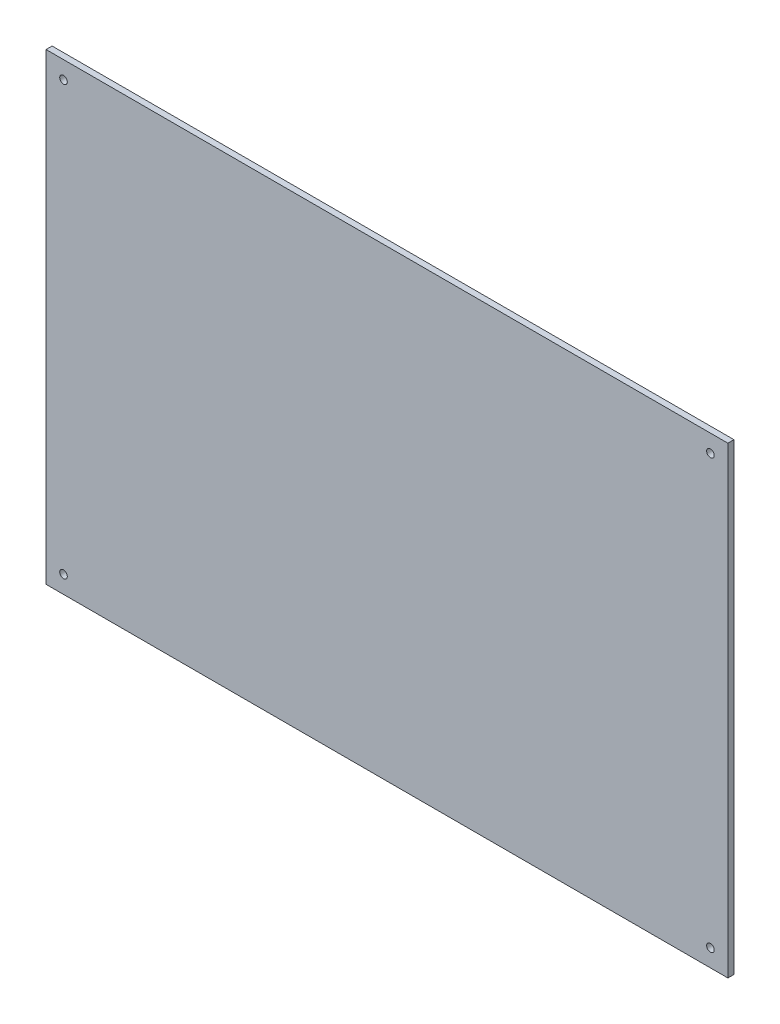
ISO-10303-21;
HEADER;
FILE_DESCRIPTION(('STEP AP214'),'2;1');
FILE_NAME('part.step','',(''),(''),'','','');
FILE_SCHEMA(('AUTOMOTIVE_DESIGN { 1 0 10303 214 1 1 1 1 }'));
ENDSEC;
DATA;
#1=APPLICATION_CONTEXT('core data for automotive mechanical design processes');
#2=APPLICATION_PROTOCOL_DEFINITION('international standard','automotive_design',2000,#1);
#3=PRODUCT_CONTEXT('',#1,'mechanical');
#4=PRODUCT('Part','Part','',(#3));
#5=PRODUCT_RELATED_PRODUCT_CATEGORY('part','',(#4));
#6=PRODUCT_DEFINITION_FORMATION('','',#4);
#7=PRODUCT_DEFINITION_CONTEXT('part definition',#1,'design');
#8=PRODUCT_DEFINITION('design','',#6,#7);
#9=PRODUCT_DEFINITION_SHAPE('','',#8);
#10=(LENGTH_UNIT() NAMED_UNIT(*) SI_UNIT(.MILLI.,.METRE.));
#11=(NAMED_UNIT(*) PLANE_ANGLE_UNIT() SI_UNIT($,.RADIAN.));
#12=(NAMED_UNIT(*) SI_UNIT($,.STERADIAN.) SOLID_ANGLE_UNIT());
#13=UNCERTAINTY_MEASURE_WITH_UNIT(LENGTH_MEASURE(1.E-05),#10,'distance_accuracy_value','');
#14=(GEOMETRIC_REPRESENTATION_CONTEXT(3) GLOBAL_UNCERTAINTY_ASSIGNED_CONTEXT((#13)) GLOBAL_UNIT_ASSIGNED_CONTEXT((#10,
#11,#12)) REPRESENTATION_CONTEXT('',''));
#15=CARTESIAN_POINT('',(0.,0.,0.));
#16=DIRECTION('',(0.,0.,1.));
#17=DIRECTION('',(1.,0.,0.));
#18=AXIS2_PLACEMENT_3D('',#15,#16,#17);
#19=CARTESIAN_POINT('',(0.,0.,4.));
#20=DIRECTION('',(0.,0.,1.));
#21=DIRECTION('',(1.,0.,0.));
#22=AXIS2_PLACEMENT_3D('',#19,#20,#21);
#23=PLANE('',#22);
#24=CARTESIAN_POINT('',(-11.5000000000001,293.5,4.));
#25=DIRECTION('',(0.,0.,1.));
#26=DIRECTION('',(-1.,0.,0.));
#27=AXIS2_PLACEMENT_3D('',#24,#25,#26);
#28=CIRCLE('',#27,2.50000000000002);
#29=CARTESIAN_POINT('',(-14.0000000000001,293.5,4.));
#30=VERTEX_POINT('',#29);
#31=EDGE_CURVE('E127',#30,#30,#28,.T.);
#32=ORIENTED_EDGE('',*,*,#31,.F.);
#33=EDGE_LOOP('',(#32));
#34=FACE_BOUND('',#33,.T.);
#35=CARTESIAN_POINT('',(-437.5,293.5,4.));
#36=DIRECTION('',(0.,0.,1.));
#37=DIRECTION('',(1.,0.,0.));
#38=AXIS2_PLACEMENT_3D('',#35,#36,#37);
#39=CIRCLE('',#38,2.50000000000002);
#40=CARTESIAN_POINT('',(-435.,293.5,4.));
#41=VERTEX_POINT('',#40);
#42=EDGE_CURVE('E106',#41,#41,#39,.T.);
#43=ORIENTED_EDGE('',*,*,#42,.F.);
#44=EDGE_LOOP('',(#43));
#45=FACE_BOUND('',#44,.T.);
#46=DIRECTION('',(0.,1.,0.));
#47=VECTOR('',#46,1.);
#48=CARTESIAN_POINT('',(0.,0.,4.));
#49=LINE('',#48,#47);
#50=CARTESIAN_POINT('',(0.,0.,4.));
#51=VERTEX_POINT('',#50);
#52=CARTESIAN_POINT('',(-1.11022302462516E-13,305.,4.));
#53=VERTEX_POINT('',#52);
#54=EDGE_CURVE('E91',#51,#53,#49,.T.);
#55=ORIENTED_EDGE('',*,*,#54,.T.);
#56=DIRECTION('',(-1.,0.,0.));
#57=VECTOR('',#56,1.);
#58=CARTESIAN_POINT('',(-1.11022302462516E-13,305.,4.));
#59=LINE('',#58,#57);
#60=CARTESIAN_POINT('',(-449.,305.,4.));
#61=VERTEX_POINT('',#60);
#62=EDGE_CURVE('E86',#53,#61,#59,.T.);
#63=ORIENTED_EDGE('',*,*,#62,.T.);
#64=DIRECTION('',(0.,-1.,0.));
#65=VECTOR('',#64,1.);
#66=CARTESIAN_POINT('',(-449.,0.,4.));
#67=LINE('',#66,#65);
#68=CARTESIAN_POINT('',(-449.,0.,4.));
#69=VERTEX_POINT('',#68);
#70=EDGE_CURVE('E89',#61,#69,#67,.T.);
#71=ORIENTED_EDGE('',*,*,#70,.T.);
#72=DIRECTION('',(1.,0.,0.));
#73=VECTOR('',#72,1.);
#74=CARTESIAN_POINT('',(0.,0.,4.));
#75=LINE('',#74,#73);
#76=EDGE_CURVE('E56',#69,#51,#75,.T.);
#77=ORIENTED_EDGE('',*,*,#76,.T.);
#78=EDGE_LOOP('',(#55,#63,#71,#77));
#79=FACE_BOUND('',#78,.T.);
#80=CARTESIAN_POINT('',(-437.5,11.5,4.));
#81=DIRECTION('',(0.,0.,1.));
#82=DIRECTION('',(-1.,0.,0.));
#83=AXIS2_PLACEMENT_3D('',#80,#81,#82);
#84=CIRCLE('',#83,2.50000000000002);
#85=CARTESIAN_POINT('',(-440.,11.5,4.));
#86=VERTEX_POINT('',#85);
#87=EDGE_CURVE('E121',#86,#86,#84,.T.);
#88=ORIENTED_EDGE('',*,*,#87,.F.);
#89=EDGE_LOOP('',(#88));
#90=FACE_BOUND('',#89,.T.);
#91=CARTESIAN_POINT('',(-11.5000000000001,11.5,4.));
#92=DIRECTION('',(0.,0.,1.));
#93=DIRECTION('',(1.,0.,0.));
#94=AXIS2_PLACEMENT_3D('',#91,#92,#93);
#95=CIRCLE('',#94,2.50000000000002);
#96=CARTESIAN_POINT('',(-9.00000000000005,11.5,4.));
#97=VERTEX_POINT('',#96);
#98=EDGE_CURVE('E133',#97,#97,#95,.T.);
#99=ORIENTED_EDGE('',*,*,#98,.F.);
#100=EDGE_LOOP('',(#99));
#101=FACE_BOUND('',#100,.T.);
#102=ADVANCED_FACE('F39',(#34,#45,#79,#90,#101),#23,.T.);
#103=CARTESIAN_POINT('',(0.,0.,0.));
#104=DIRECTION('',(0.,0.,1.));
#105=DIRECTION('',(1.,0.,0.));
#106=AXIS2_PLACEMENT_3D('',#103,#104,#105);
#107=PLANE('',#106);
#108=DIRECTION('',(0.,1.,0.));
#109=VECTOR('',#108,1.);
#110=CARTESIAN_POINT('',(0.,0.,0.));
#111=LINE('',#110,#109);
#112=CARTESIAN_POINT('',(0.,0.,0.));
#113=VERTEX_POINT('',#112);
#114=CARTESIAN_POINT('',(-1.11022302462516E-13,305.,0.));
#115=VERTEX_POINT('',#114);
#116=EDGE_CURVE('E103',#113,#115,#111,.T.);
#117=ORIENTED_EDGE('',*,*,#116,.F.);
#118=DIRECTION('',(1.,0.,0.));
#119=VECTOR('',#118,1.);
#120=CARTESIAN_POINT('',(0.,0.,0.));
#121=LINE('',#120,#119);
#122=CARTESIAN_POINT('',(-449.,0.,0.));
#123=VERTEX_POINT('',#122);
#124=EDGE_CURVE('E79',#123,#113,#121,.T.);
#125=ORIENTED_EDGE('',*,*,#124,.F.);
#126=DIRECTION('',(0.,-1.,0.));
#127=VECTOR('',#126,1.);
#128=CARTESIAN_POINT('',(-449.,0.,0.));
#129=LINE('',#128,#127);
#130=CARTESIAN_POINT('',(-449.,305.,0.));
#131=VERTEX_POINT('',#130);
#132=EDGE_CURVE('E73',#131,#123,#129,.T.);
#133=ORIENTED_EDGE('',*,*,#132,.F.);
#134=DIRECTION('',(-1.,0.,0.));
#135=VECTOR('',#134,1.);
#136=CARTESIAN_POINT('',(-1.11022302462516E-13,305.,0.));
#137=LINE('',#136,#135);
#138=EDGE_CURVE('E95',#115,#131,#137,.T.);
#139=ORIENTED_EDGE('',*,*,#138,.F.);
#140=EDGE_LOOP('',(#117,#125,#133,#139));
#141=FACE_BOUND('',#140,.T.);
#142=CARTESIAN_POINT('',(-437.5,293.5,0.));
#143=DIRECTION('',(0.,0.,1.));
#144=DIRECTION('',(1.,0.,0.));
#145=AXIS2_PLACEMENT_3D('',#142,#143,#144);
#146=CIRCLE('',#145,2.50000000000002);
#147=CARTESIAN_POINT('',(-435.,293.5,0.));
#148=VERTEX_POINT('',#147);
#149=EDGE_CURVE('E118',#148,#148,#146,.T.);
#150=ORIENTED_EDGE('',*,*,#149,.T.);
#151=EDGE_LOOP('',(#150));
#152=FACE_BOUND('',#151,.T.);
#153=CARTESIAN_POINT('',(-437.5,11.5,0.));
#154=DIRECTION('',(0.,0.,1.));
#155=DIRECTION('',(-1.,0.,0.));
#156=AXIS2_PLACEMENT_3D('',#153,#154,#155);
#157=CIRCLE('',#156,2.50000000000002);
#158=CARTESIAN_POINT('',(-440.,11.5,0.));
#159=VERTEX_POINT('',#158);
#160=EDGE_CURVE('E124',#159,#159,#157,.T.);
#161=ORIENTED_EDGE('',*,*,#160,.T.);
#162=EDGE_LOOP('',(#161));
#163=FACE_BOUND('',#162,.T.);
#164=CARTESIAN_POINT('',(-11.5000000000001,293.5,0.));
#165=DIRECTION('',(0.,0.,1.));
#166=DIRECTION('',(-1.,0.,0.));
#167=AXIS2_PLACEMENT_3D('',#164,#165,#166);
#168=CIRCLE('',#167,2.50000000000002);
#169=CARTESIAN_POINT('',(-14.0000000000001,293.5,0.));
#170=VERTEX_POINT('',#169);
#171=EDGE_CURVE('E130',#170,#170,#168,.T.);
#172=ORIENTED_EDGE('',*,*,#171,.T.);
#173=EDGE_LOOP('',(#172));
#174=FACE_BOUND('',#173,.T.);
#175=CARTESIAN_POINT('',(-11.5000000000001,11.5,0.));
#176=DIRECTION('',(0.,0.,1.));
#177=DIRECTION('',(1.,0.,0.));
#178=AXIS2_PLACEMENT_3D('',#175,#176,#177);
#179=CIRCLE('',#178,2.50000000000002);
#180=CARTESIAN_POINT('',(-9.00000000000005,11.5,0.));
#181=VERTEX_POINT('',#180);
#182=EDGE_CURVE('E136',#181,#181,#179,.T.);
#183=ORIENTED_EDGE('',*,*,#182,.T.);
#184=EDGE_LOOP('',(#183));
#185=FACE_BOUND('',#184,.T.);
#186=ADVANCED_FACE('F114',(#141,#152,#163,#174,#185),#107,.F.);
#187=CARTESIAN_POINT('',(0.,0.,4.));
#188=DIRECTION('',(-1.,0.,0.));
#189=DIRECTION('',(0.,-1.,0.));
#190=AXIS2_PLACEMENT_3D('',#187,#188,#189);
#191=PLANE('',#190);
#192=ORIENTED_EDGE('',*,*,#116,.T.);
#193=DIRECTION('',(0.,0.,-1.));
#194=VECTOR('',#193,1.);
#195=CARTESIAN_POINT('',(-1.11022302462516E-13,305.,4.));
#196=LINE('',#195,#194);
#197=EDGE_CURVE('E11',#53,#115,#196,.T.);
#198=ORIENTED_EDGE('',*,*,#197,.F.);
#199=ORIENTED_EDGE('',*,*,#54,.F.);
#200=DIRECTION('',(0.,0.,-1.));
#201=VECTOR('',#200,1.);
#202=CARTESIAN_POINT('',(0.,0.,4.));
#203=LINE('',#202,#201);
#204=EDGE_CURVE('E99',#51,#113,#203,.T.);
#205=ORIENTED_EDGE('',*,*,#204,.T.);
#206=EDGE_LOOP('',(#192,#198,#199,#205));
#207=FACE_BOUND('',#206,.T.);
#208=ADVANCED_FACE('F41',(#207),#191,.F.);
#209=CARTESIAN_POINT('',(-1.11022302462516E-13,305.,4.));
#210=DIRECTION('',(0.,-1.,0.));
#211=DIRECTION('',(1.,0.,0.));
#212=AXIS2_PLACEMENT_3D('',#209,#210,#211);
#213=PLANE('',#212);
#214=ORIENTED_EDGE('',*,*,#138,.T.);
#215=DIRECTION('',(0.,0.,-1.));
#216=VECTOR('',#215,1.);
#217=CARTESIAN_POINT('',(-449.,305.,4.));
#218=LINE('',#217,#216);
#219=EDGE_CURVE('E48',#61,#131,#218,.T.);
#220=ORIENTED_EDGE('',*,*,#219,.F.);
#221=ORIENTED_EDGE('',*,*,#62,.F.);
#222=ORIENTED_EDGE('',*,*,#197,.T.);
#223=EDGE_LOOP('',(#214,#220,#221,#222));
#224=FACE_BOUND('',#223,.T.);
#225=ADVANCED_FACE('F94',(#224),#213,.F.);
#226=CARTESIAN_POINT('',(-449.,0.,4.));
#227=DIRECTION('',(1.,0.,0.));
#228=DIRECTION('',(0.,1.,0.));
#229=AXIS2_PLACEMENT_3D('',#226,#227,#228);
#230=PLANE('',#229);
#231=ORIENTED_EDGE('',*,*,#132,.T.);
#232=DIRECTION('',(0.,0.,-1.));
#233=VECTOR('',#232,1.);
#234=CARTESIAN_POINT('',(-449.,0.,4.));
#235=LINE('',#234,#233);
#236=EDGE_CURVE('E96',#69,#123,#235,.T.);
#237=ORIENTED_EDGE('',*,*,#236,.F.);
#238=ORIENTED_EDGE('',*,*,#70,.F.);
#239=ORIENTED_EDGE('',*,*,#219,.T.);
#240=EDGE_LOOP('',(#231,#237,#238,#239));
#241=FACE_BOUND('',#240,.T.);
#242=ADVANCED_FACE('F97',(#241),#230,.F.);
#243=CARTESIAN_POINT('',(0.,0.,4.));
#244=DIRECTION('',(0.,1.,0.));
#245=DIRECTION('',(-1.,0.,0.));
#246=AXIS2_PLACEMENT_3D('',#243,#244,#245);
#247=PLANE('',#246);
#248=ORIENTED_EDGE('',*,*,#124,.T.);
#249=ORIENTED_EDGE('',*,*,#204,.F.);
#250=ORIENTED_EDGE('',*,*,#76,.F.);
#251=ORIENTED_EDGE('',*,*,#236,.T.);
#252=EDGE_LOOP('',(#248,#249,#250,#251));
#253=FACE_BOUND('',#252,.T.);
#254=ADVANCED_FACE('F111',(#253),#247,.F.);
#255=CARTESIAN_POINT('',(-437.5,293.5,4.));
#256=DIRECTION('',(0.,0.,-1.));
#257=DIRECTION('',(-1.,0.,0.));
#258=AXIS2_PLACEMENT_3D('',#255,#256,#257);
#259=CYLINDRICAL_SURFACE('',#258,2.50000000000002);
#260=ORIENTED_EDGE('',*,*,#42,.T.);
#261=EDGE_LOOP('',(#260));
#262=FACE_BOUND('',#261,.T.);
#263=ORIENTED_EDGE('',*,*,#149,.F.);
#264=EDGE_LOOP('',(#263));
#265=FACE_BOUND('',#264,.T.);
#266=ADVANCED_FACE('F155',(#262,#265),#259,.F.);
#267=CARTESIAN_POINT('',(-437.5,11.5,4.));
#268=DIRECTION('',(0.,0.,-1.));
#269=DIRECTION('',(-1.,0.,0.));
#270=AXIS2_PLACEMENT_3D('',#267,#268,#269);
#271=CYLINDRICAL_SURFACE('',#270,2.50000000000002);
#272=ORIENTED_EDGE('',*,*,#87,.T.);
#273=EDGE_LOOP('',(#272));
#274=FACE_BOUND('',#273,.T.);
#275=ORIENTED_EDGE('',*,*,#160,.F.);
#276=EDGE_LOOP('',(#275));
#277=FACE_BOUND('',#276,.T.);
#278=ADVANCED_FACE('F203',(#274,#277),#271,.F.);
#279=CARTESIAN_POINT('',(-11.5000000000001,293.5,4.));
#280=DIRECTION('',(0.,0.,-1.));
#281=DIRECTION('',(-1.,0.,0.));
#282=AXIS2_PLACEMENT_3D('',#279,#280,#281);
#283=CYLINDRICAL_SURFACE('',#282,2.50000000000002);
#284=ORIENTED_EDGE('',*,*,#31,.T.);
#285=EDGE_LOOP('',(#284));
#286=FACE_BOUND('',#285,.T.);
#287=ORIENTED_EDGE('',*,*,#171,.F.);
#288=EDGE_LOOP('',(#287));
#289=FACE_BOUND('',#288,.T.);
#290=ADVANCED_FACE('F211',(#286,#289),#283,.F.);
#291=CARTESIAN_POINT('',(-11.5000000000001,11.5,4.));
#292=DIRECTION('',(0.,0.,-1.));
#293=DIRECTION('',(-1.,0.,0.));
#294=AXIS2_PLACEMENT_3D('',#291,#292,#293);
#295=CYLINDRICAL_SURFACE('',#294,2.50000000000002);
#296=ORIENTED_EDGE('',*,*,#98,.T.);
#297=EDGE_LOOP('',(#296));
#298=FACE_BOUND('',#297,.T.);
#299=ORIENTED_EDGE('',*,*,#182,.F.);
#300=EDGE_LOOP('',(#299));
#301=FACE_BOUND('',#300,.T.);
#302=ADVANCED_FACE('F142',(#298,#301),#295,.F.);
#303=CLOSED_SHELL('',(#102,#186,#208,#225,#242,#254,#266,#278,#290,#302));
#304=MANIFOLD_SOLID_BREP('B2',#303);
#305=ADVANCED_BREP_SHAPE_REPRESENTATION('',(#18,#304),#14);
#306=SHAPE_DEFINITION_REPRESENTATION(#9,#305);
ENDSEC;
END-ISO-10303-21;
